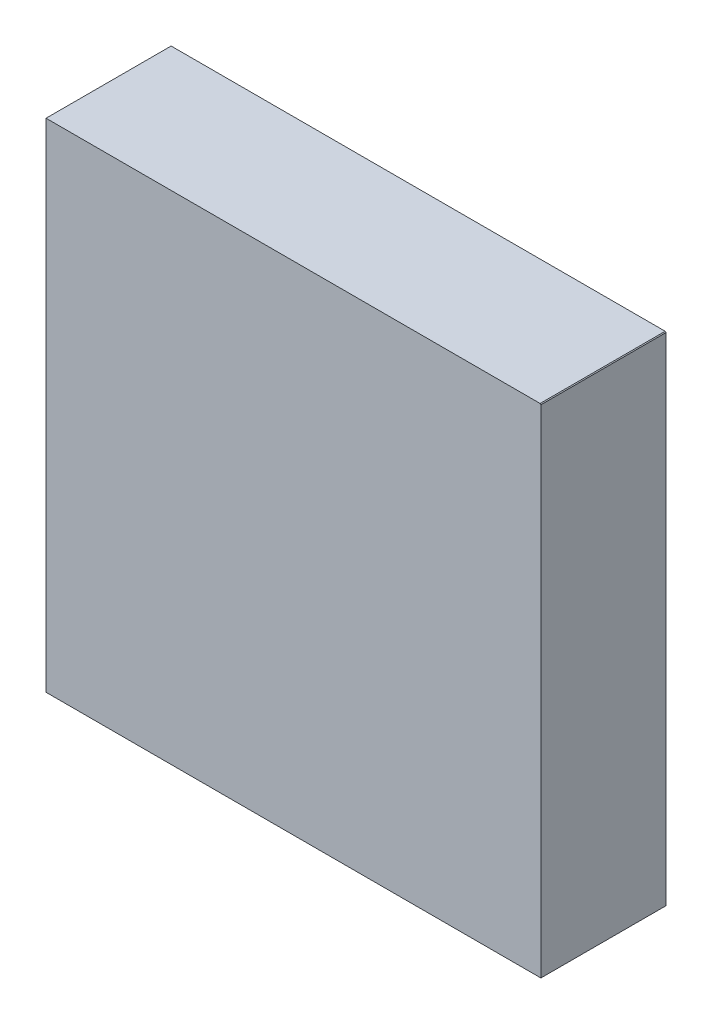
ISO-10303-21;
HEADER;
FILE_DESCRIPTION(('STEP AP214'),'2;1');
FILE_NAME('part.step','',(''),(''),'','','');
FILE_SCHEMA(('AUTOMOTIVE_DESIGN { 1 0 10303 214 1 1 1 1 }'));
ENDSEC;
DATA;
#1=APPLICATION_CONTEXT('core data for automotive mechanical design processes');
#2=APPLICATION_PROTOCOL_DEFINITION('international standard','automotive_design',2000,#1);
#3=PRODUCT_CONTEXT('',#1,'mechanical');
#4=PRODUCT('Part','Part','',(#3));
#5=PRODUCT_RELATED_PRODUCT_CATEGORY('part','',(#4));
#6=PRODUCT_DEFINITION_FORMATION('','',#4);
#7=PRODUCT_DEFINITION_CONTEXT('part definition',#1,'design');
#8=PRODUCT_DEFINITION('design','',#6,#7);
#9=PRODUCT_DEFINITION_SHAPE('','',#8);
#10=(LENGTH_UNIT() NAMED_UNIT(*) SI_UNIT(.MILLI.,.METRE.));
#11=(NAMED_UNIT(*) PLANE_ANGLE_UNIT() SI_UNIT($,.RADIAN.));
#12=(NAMED_UNIT(*) SI_UNIT($,.STERADIAN.) SOLID_ANGLE_UNIT());
#13=UNCERTAINTY_MEASURE_WITH_UNIT(LENGTH_MEASURE(1.E-05),#10,'distance_accuracy_value','');
#14=(GEOMETRIC_REPRESENTATION_CONTEXT(3) GLOBAL_UNCERTAINTY_ASSIGNED_CONTEXT((#13)) GLOBAL_UNIT_ASSIGNED_CONTEXT((#10,
#11,#12)) REPRESENTATION_CONTEXT('',''));
#15=CARTESIAN_POINT('',(0.,0.,0.));
#16=DIRECTION('',(0.,0.,1.));
#17=DIRECTION('',(1.,0.,0.));
#18=AXIS2_PLACEMENT_3D('',#15,#16,#17);
#19=CARTESIAN_POINT('',(-1.58250128,1.58999936,0.80000094));
#20=DIRECTION('',(0.,0.,-1.));
#21=DIRECTION('',(0.,-1.,0.));
#22=AXIS2_PLACEMENT_3D('',#19,#20,#21);
#23=PLANE('',#22);
#24=DIRECTION('',(0.,-1.,0.));
#25=VECTOR('',#24,1.);
#26=CARTESIAN_POINT('',(-1.58250128,1.58999936,0.80000094));
#27=LINE('',#26,#25);
#28=CARTESIAN_POINT('',(-1.58250128,1.58999936,0.80000094));
#29=VERTEX_POINT('',#28);
#30=CARTESIAN_POINT('',(-1.5824962,-1.58999682,0.80000094));
#31=VERTEX_POINT('',#30);
#32=EDGE_CURVE('E69',#29,#31,#27,.T.);
#33=ORIENTED_EDGE('',*,*,#32,.T.);
#34=DIRECTION('',(1.,0.,0.));
#35=VECTOR('',#34,1.);
#36=CARTESIAN_POINT('',(-1.5824962,-1.58999682,0.80000094));
#37=LINE('',#36,#35);
#38=CARTESIAN_POINT('',(1.58250128,-1.58999682,0.80000094));
#39=VERTEX_POINT('',#38);
#40=EDGE_CURVE('E101',#31,#39,#37,.T.);
#41=ORIENTED_EDGE('',*,*,#40,.T.);
#42=DIRECTION('',(0.,1.,0.));
#43=VECTOR('',#42,1.);
#44=CARTESIAN_POINT('',(1.58250128,-1.58999682,0.80000094));
#45=LINE('',#44,#43);
#46=CARTESIAN_POINT('',(1.58250128,1.5849981,0.80000094));
#47=VERTEX_POINT('',#46);
#48=EDGE_CURVE('E135',#39,#47,#45,.T.);
#49=ORIENTED_EDGE('',*,*,#48,.T.);
#50=DIRECTION('',(-0.707106781186548,0.707106781186548,0.));
#51=VECTOR('',#50,1.);
#52=CARTESIAN_POINT('',(1.58250128,1.5849981,0.80000094));
#53=LINE('',#52,#51);
#54=CARTESIAN_POINT('',(1.57750002,1.58999936,0.80000094));
#55=VERTEX_POINT('',#54);
#56=EDGE_CURVE('E73',#47,#55,#53,.T.);
#57=ORIENTED_EDGE('',*,*,#56,.T.);
#58=DIRECTION('',(-1.,0.,0.));
#59=VECTOR('',#58,1.);
#60=CARTESIAN_POINT('',(1.57750002,1.58999936,0.80000094));
#61=LINE('',#60,#59);
#62=EDGE_CURVE('E26',#55,#29,#61,.T.);
#63=ORIENTED_EDGE('',*,*,#62,.T.);
#64=EDGE_LOOP('',(#33,#41,#49,#57,#63));
#65=FACE_BOUND('',#64,.T.);
#66=ADVANCED_FACE('F16',(#65),#23,.F.);
#67=CARTESIAN_POINT('',(-1.58250128,1.58999936,0.));
#68=DIRECTION('',(0.,0.,-1.));
#69=DIRECTION('',(0.,-1.,0.));
#70=AXIS2_PLACEMENT_3D('',#67,#68,#69);
#71=PLANE('',#70);
#72=DIRECTION('',(-1.,0.,0.));
#73=VECTOR('',#72,1.);
#74=CARTESIAN_POINT('',(1.57750002,1.58999936,0.));
#75=LINE('',#74,#73);
#76=CARTESIAN_POINT('',(1.57750002,1.58999936,0.));
#77=VERTEX_POINT('',#76);
#78=CARTESIAN_POINT('',(-1.58250128,1.58999936,0.));
#79=VERTEX_POINT('',#78);
#80=EDGE_CURVE('E76',#77,#79,#75,.T.);
#81=ORIENTED_EDGE('',*,*,#80,.F.);
#82=DIRECTION('',(-0.707106781186548,0.707106781186548,0.));
#83=VECTOR('',#82,1.);
#84=CARTESIAN_POINT('',(1.58250128,1.5849981,0.));
#85=LINE('',#84,#83);
#86=CARTESIAN_POINT('',(1.58250128,1.5849981,0.));
#87=VERTEX_POINT('',#86);
#88=EDGE_CURVE('E124',#87,#77,#85,.T.);
#89=ORIENTED_EDGE('',*,*,#88,.F.);
#90=DIRECTION('',(0.,1.,0.));
#91=VECTOR('',#90,1.);
#92=CARTESIAN_POINT('',(1.58250128,-1.58999682,0.));
#93=LINE('',#92,#91);
#94=CARTESIAN_POINT('',(1.58250128,-1.58999682,0.));
#95=VERTEX_POINT('',#94);
#96=EDGE_CURVE('E104',#95,#87,#93,.T.);
#97=ORIENTED_EDGE('',*,*,#96,.F.);
#98=DIRECTION('',(1.,0.,0.));
#99=VECTOR('',#98,1.);
#100=CARTESIAN_POINT('',(-1.5824962,-1.58999682,0.));
#101=LINE('',#100,#99);
#102=CARTESIAN_POINT('',(-1.5824962,-1.58999682,0.));
#103=VERTEX_POINT('',#102);
#104=EDGE_CURVE('E85',#103,#95,#101,.T.);
#105=ORIENTED_EDGE('',*,*,#104,.F.);
#106=DIRECTION('',(0.,-1.,0.));
#107=VECTOR('',#106,1.);
#108=CARTESIAN_POINT('',(-1.58250128,1.58999936,0.));
#109=LINE('',#108,#107);
#110=EDGE_CURVE('E88',#79,#103,#109,.T.);
#111=ORIENTED_EDGE('',*,*,#110,.F.);
#112=EDGE_LOOP('',(#81,#89,#97,#105,#111));
#113=FACE_BOUND('',#112,.T.);
#114=ADVANCED_FACE('F150',(#113),#71,.T.);
#115=CARTESIAN_POINT('',(1.57750002,1.58999936,0.));
#116=DIRECTION('',(0.,-1.,0.));
#117=DIRECTION('',(0.,0.,-1.));
#118=AXIS2_PLACEMENT_3D('',#115,#116,#117);
#119=PLANE('',#118);
#120=ORIENTED_EDGE('',*,*,#80,.T.);
#121=DIRECTION('',(0.,0.,1.));
#122=VECTOR('',#121,1.);
#123=CARTESIAN_POINT('',(-1.58250128,1.58999936,0.));
#124=LINE('',#123,#122);
#125=EDGE_CURVE('E79',#79,#29,#124,.T.);
#126=ORIENTED_EDGE('',*,*,#125,.T.);
#127=ORIENTED_EDGE('',*,*,#62,.F.);
#128=DIRECTION('',(0.,0.,1.));
#129=VECTOR('',#128,1.);
#130=CARTESIAN_POINT('',(1.57750002,1.58999936,0.));
#131=LINE('',#130,#129);
#132=EDGE_CURVE('E127',#77,#55,#131,.T.);
#133=ORIENTED_EDGE('',*,*,#132,.F.);
#134=EDGE_LOOP('',(#120,#126,#127,#133));
#135=FACE_BOUND('',#134,.T.);
#136=ADVANCED_FACE('F80',(#135),#119,.F.);
#137=CARTESIAN_POINT('',(1.58250128,1.5849981,0.));
#138=DIRECTION('',(-0.707106781186548,-0.707106781186548,0.));
#139=DIRECTION('',(-0.707106781186548,0.707106781186548,0.));
#140=AXIS2_PLACEMENT_3D('',#137,#138,#139);
#141=PLANE('',#140);
#142=ORIENTED_EDGE('',*,*,#88,.T.);
#143=ORIENTED_EDGE('',*,*,#132,.T.);
#144=ORIENTED_EDGE('',*,*,#56,.F.);
#145=DIRECTION('',(0.,0.,1.));
#146=VECTOR('',#145,1.);
#147=CARTESIAN_POINT('',(1.58250128,1.5849981,0.));
#148=LINE('',#147,#146);
#149=EDGE_CURVE('E97',#87,#47,#148,.T.);
#150=ORIENTED_EDGE('',*,*,#149,.F.);
#151=EDGE_LOOP('',(#142,#143,#144,#150));
#152=FACE_BOUND('',#151,.T.);
#153=ADVANCED_FACE('F152',(#152),#141,.F.);
#154=CARTESIAN_POINT('',(1.58250128,-1.58999682,0.));
#155=DIRECTION('',(-1.,0.,0.));
#156=DIRECTION('',(0.,0.,1.));
#157=AXIS2_PLACEMENT_3D('',#154,#155,#156);
#158=PLANE('',#157);
#159=ORIENTED_EDGE('',*,*,#96,.T.);
#160=ORIENTED_EDGE('',*,*,#149,.T.);
#161=ORIENTED_EDGE('',*,*,#48,.F.);
#162=DIRECTION('',(0.,0.,1.));
#163=VECTOR('',#162,1.);
#164=CARTESIAN_POINT('',(1.58250128,-1.58999682,0.));
#165=LINE('',#164,#163);
#166=EDGE_CURVE('E105',#95,#39,#165,.T.);
#167=ORIENTED_EDGE('',*,*,#166,.F.);
#168=EDGE_LOOP('',(#159,#160,#161,#167));
#169=FACE_BOUND('',#168,.T.);
#170=ADVANCED_FACE('F147',(#169),#158,.F.);
#171=CARTESIAN_POINT('',(-1.5824962,-1.58999682,0.));
#172=DIRECTION('',(0.,1.,0.));
#173=DIRECTION('',(1.,0.,0.));
#174=AXIS2_PLACEMENT_3D('',#171,#172,#173);
#175=PLANE('',#174);
#176=DIRECTION('',(0.,0.,-1.));
#177=VECTOR('',#176,1.);
#178=CARTESIAN_POINT('',(-1.58250128,-1.58999682,0.));
#179=LINE('',#178,#177);
#180=EDGE_CURVE('E11',#103,#31,#179,.F.);
#181=ORIENTED_EDGE('',*,*,#180,.F.);
#182=ORIENTED_EDGE('',*,*,#104,.T.);
#183=ORIENTED_EDGE('',*,*,#166,.T.);
#184=ORIENTED_EDGE('',*,*,#40,.F.);
#185=EDGE_LOOP('',(#181,#182,#183,#184));
#186=FACE_BOUND('',#185,.T.);
#187=ADVANCED_FACE('F222',(#186),#175,.F.);
#188=CARTESIAN_POINT('',(-1.58250128,1.58999936,0.));
#189=DIRECTION('',(1.,0.,0.));
#190=DIRECTION('',(0.,1.,0.));
#191=AXIS2_PLACEMENT_3D('',#188,#189,#190);
#192=PLANE('',#191);
#193=ORIENTED_EDGE('',*,*,#110,.T.);
#194=ORIENTED_EDGE('',*,*,#180,.T.);
#195=ORIENTED_EDGE('',*,*,#32,.F.);
#196=ORIENTED_EDGE('',*,*,#125,.F.);
#197=EDGE_LOOP('',(#193,#194,#195,#196));
#198=FACE_BOUND('',#197,.T.);
#199=ADVANCED_FACE('F18',(#198),#192,.F.);
#200=CLOSED_SHELL('',(#66,#114,#136,#153,#170,#187,#199));
#201=MANIFOLD_SOLID_BREP('B1',#200);
#202=ADVANCED_BREP_SHAPE_REPRESENTATION('',(#18,#201),#14);
#203=SHAPE_DEFINITION_REPRESENTATION(#9,#202);
ENDSEC;
END-ISO-10303-21;
